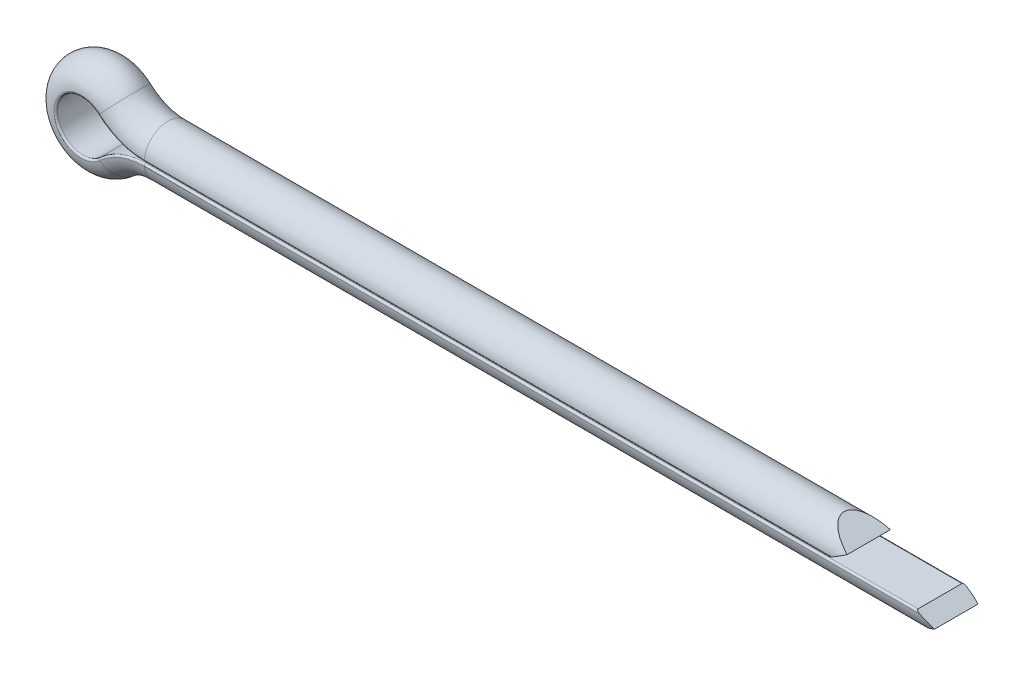
ISO-10303-21;
HEADER;
FILE_DESCRIPTION(('STEP AP214'),'2;1');
FILE_NAME('part.step','',(''),(''),'','','');
FILE_SCHEMA(('AUTOMOTIVE_DESIGN { 1 0 10303 214 1 1 1 1 }'));
ENDSEC;
DATA;
#1=APPLICATION_CONTEXT('core data for automotive mechanical design processes');
#2=APPLICATION_PROTOCOL_DEFINITION('international standard','automotive_design',2000,#1);
#3=PRODUCT_CONTEXT('',#1,'mechanical');
#4=PRODUCT('Part','Part','',(#3));
#5=PRODUCT_RELATED_PRODUCT_CATEGORY('part','',(#4));
#6=PRODUCT_DEFINITION_FORMATION('','',#4);
#7=PRODUCT_DEFINITION_CONTEXT('part definition',#1,'design');
#8=PRODUCT_DEFINITION('design','',#6,#7);
#9=PRODUCT_DEFINITION_SHAPE('','',#8);
#10=(LENGTH_UNIT() NAMED_UNIT(*) SI_UNIT(.MILLI.,.METRE.));
#11=(NAMED_UNIT(*) PLANE_ANGLE_UNIT() SI_UNIT($,.RADIAN.));
#12=(NAMED_UNIT(*) SI_UNIT($,.STERADIAN.) SOLID_ANGLE_UNIT());
#13=UNCERTAINTY_MEASURE_WITH_UNIT(LENGTH_MEASURE(1.E-05),#10,'distance_accuracy_value','');
#14=(GEOMETRIC_REPRESENTATION_CONTEXT(3) GLOBAL_UNCERTAINTY_ASSIGNED_CONTEXT((#13)) GLOBAL_UNIT_ASSIGNED_CONTEXT((#10,
#11,#12)) REPRESENTATION_CONTEXT('',''));
#15=CARTESIAN_POINT('',(0.,0.,0.));
#16=DIRECTION('',(0.,0.,1.));
#17=DIRECTION('',(1.,0.,0.));
#18=AXIS2_PLACEMENT_3D('',#15,#16,#17);
#19=CARTESIAN_POINT('',(21.8,0.0249999999999998,0.));
#20=DIRECTION('',(-1.,0.,0.));
#21=DIRECTION('',(0.,0.,1.));
#22=AXIS2_PLACEMENT_3D('',#19,#20,#21);
#23=CYLINDRICAL_SURFACE('',#22,0.675);
#24=CARTESIAN_POINT('',(1.8,0.0249999999999998,0.));
#25=DIRECTION('',(1.,0.,0.));
#26=DIRECTION('',(0.,0.,1.));
#27=AXIS2_PLACEMENT_3D('',#24,#25,#26);
#28=CIRCLE('',#27,0.675);
#29=CARTESIAN_POINT('',(1.8,0.0789999999999996,-0.672836532896364));
#30=VERTEX_POINT('',#29);
#31=CARTESIAN_POINT('',(1.8,0.0789999999999996,0.672836532896364));
#32=VERTEX_POINT('',#31);
#33=EDGE_CURVE('E171',#30,#32,#28,.T.);
#34=ORIENTED_EDGE('',*,*,#33,.T.);
#35=DIRECTION('',(-1.,0.,0.));
#36=VECTOR('',#35,1.);
#37=CARTESIAN_POINT('',(21.8,0.0789999999999996,0.672836532896364));
#38=LINE('',#37,#36);
#39=CARTESIAN_POINT('',(21.4258770255651,0.0789999999999993,0.672836532896364));
#40=VERTEX_POINT('',#39);
#41=EDGE_CURVE('E49',#32,#40,#38,.F.);
#42=ORIENTED_EDGE('',*,*,#41,.T.);
#43=CARTESIAN_POINT('',(21.3323462819564,0.0249999999999998,0.));
#44=DIRECTION('',(-0.500000000000001,0.866025403784438,0.));
#45=DIRECTION('',(-0.866025403784438,-0.500000000000002,0.));
#46=AXIS2_PLACEMENT_3D('',#43,#44,#45);
#47=ELLIPSE('',#46,1.35,0.675);
#48=CARTESIAN_POINT('',(21.8,0.295,0.618647718819038));
#49=VERTEX_POINT('',#48);
#50=EDGE_CURVE('E170',#40,#49,#47,.T.);
#51=ORIENTED_EDGE('',*,*,#50,.T.);
#52=CARTESIAN_POINT('',(22.2676537180436,0.0249999999999998,0.));
#53=DIRECTION('',(-0.499999999999994,-0.866025403784442,0.));
#54=DIRECTION('',(-0.866025403784442,0.499999999999994,0.));
#55=AXIS2_PLACEMENT_3D('',#52,#53,#54);
#56=ELLIPSE('',#55,1.35000000000002,0.675);
#57=CARTESIAN_POINT('',(21.8,0.295,-0.618647718819039));
#58=VERTEX_POINT('',#57);
#59=EDGE_CURVE('E154',#49,#58,#56,.T.);
#60=ORIENTED_EDGE('',*,*,#59,.T.);
#61=CARTESIAN_POINT('',(21.4258770255651,0.0789999999999993,-0.672836532896364));
#62=VERTEX_POINT('',#61);
#63=EDGE_CURVE('E168',#58,#62,#47,.T.);
#64=ORIENTED_EDGE('',*,*,#63,.T.);
#65=DIRECTION('',(-1.,0.,0.));
#66=VECTOR('',#65,1.);
#67=CARTESIAN_POINT('',(21.8,0.0789999999999996,-0.672836532896364));
#68=LINE('',#67,#66);
#69=EDGE_CURVE('E234',#62,#30,#68,.T.);
#70=ORIENTED_EDGE('',*,*,#69,.T.);
#71=EDGE_LOOP('',(#34,#42,#51,#60,#64,#70));
#72=FACE_BOUND('',#71,.T.);
#73=ADVANCED_FACE('F32',(#72),#23,.T.);
#74=CARTESIAN_POINT('',(21.8,0.0249999999999996,-0.675));
#75=DIRECTION('',(0.,1.,0.));
#76=DIRECTION('',(0.,0.,1.));
#77=AXIS2_PLACEMENT_3D('',#74,#75,#76);
#78=PLANE('',#77);
#79=DIRECTION('',(0.,0.,1.));
#80=VECTOR('',#79,1.);
#81=CARTESIAN_POINT('',(21.3323462819564,0.0249999999999996,-0.675));
#82=LINE('',#81,#80);
#83=CARTESIAN_POINT('',(21.3323462819564,0.0249999999999996,-0.622996789718856));
#84=VERTEX_POINT('',#83);
#85=CARTESIAN_POINT('',(21.3323462819564,0.0249999999999996,0.622996789718855));
#86=VERTEX_POINT('',#85);
#87=EDGE_CURVE('E148',#84,#86,#82,.T.);
#88=ORIENTED_EDGE('',*,*,#87,.T.);
#89=DIRECTION('',(-1.,0.,0.));
#90=VECTOR('',#89,1.);
#91=CARTESIAN_POINT('',(21.8,0.0249999999999996,0.622996789718856));
#92=LINE('',#91,#90);
#93=CARTESIAN_POINT('',(1.8,0.0249999999999996,0.622996789718855));
#94=VERTEX_POINT('',#93);
#95=EDGE_CURVE('E232',#86,#94,#92,.T.);
#96=ORIENTED_EDGE('',*,*,#95,.T.);
#97=DIRECTION('',(0.,0.,-1.));
#98=VECTOR('',#97,1.);
#99=CARTESIAN_POINT('',(1.8,0.0249999999999996,-0.675));
#100=LINE('',#99,#98);
#101=CARTESIAN_POINT('',(1.8,0.0249999999999996,-0.622996789718856));
#102=VERTEX_POINT('',#101);
#103=EDGE_CURVE('E173',#94,#102,#100,.T.);
#104=ORIENTED_EDGE('',*,*,#103,.T.);
#105=DIRECTION('',(-1.,0.,0.));
#106=VECTOR('',#105,1.);
#107=CARTESIAN_POINT('',(21.8,0.0249999999999996,-0.622996789718856));
#108=LINE('',#107,#106);
#109=EDGE_CURVE('E230',#102,#84,#108,.F.);
#110=ORIENTED_EDGE('',*,*,#109,.T.);
#111=EDGE_LOOP('',(#88,#96,#104,#110));
#112=FACE_BOUND('',#111,.T.);
#113=ADVANCED_FACE('F271',(#112),#78,.F.);
#114=CARTESIAN_POINT('',(1.8,1.96428571428572,0.));
#115=DIRECTION('',(0.,0.,-1.));
#116=DIRECTION('',(-1.,0.,0.));
#117=AXIS2_PLACEMENT_3D('',#114,#115,#116);
#118=TOROIDAL_SURFACE('',#117,1.93928571428572,0.675);
#119=CARTESIAN_POINT('',(0.489812332439676,0.534517426273459,0.));
#120=DIRECTION('',(0.737265415549598,-0.675603217158177,0.));
#121=DIRECTION('',(0.,0.,1.));
#122=AXIS2_PLACEMENT_3D('',#119,#120,#121);
#123=CIRCLE('',#122,0.675);
#124=CARTESIAN_POINT('',(0.526294906166815,0.57432975871379,-0.672836532896221));
#125=VERTEX_POINT('',#124);
#126=CARTESIAN_POINT('',(0.526294906166792,0.574329758713765,0.672836532896226));
#127=VERTEX_POINT('',#126);
#128=EDGE_CURVE('E174',#125,#127,#123,.T.);
#129=ORIENTED_EDGE('',*,*,#128,.T.);
#130=CARTESIAN_POINT('',(1.8,1.96428571428572,0.672836532896226));
#131=DIRECTION('',(0.,0.,-1.));
#132=DIRECTION('',(-1.,0.,0.));
#133=AXIS2_PLACEMENT_3D('',#130,#131,#132);
#134=CIRCLE('',#133,1.88528571428573);
#135=EDGE_CURVE('E228',#127,#32,#134,.F.);
#136=ORIENTED_EDGE('',*,*,#135,.T.);
#137=ORIENTED_EDGE('',*,*,#33,.F.);
#138=CARTESIAN_POINT('',(1.8,1.96428571428572,-0.672836532896221));
#139=DIRECTION('',(0.,0.,1.));
#140=DIRECTION('',(1.,0.,0.));
#141=AXIS2_PLACEMENT_3D('',#138,#139,#140);
#142=CIRCLE('',#141,1.88528571428573);
#143=EDGE_CURVE('E226',#30,#125,#142,.F.);
#144=ORIENTED_EDGE('',*,*,#143,.T.);
#145=EDGE_LOOP('',(#129,#136,#137,#144));
#146=FACE_BOUND('',#145,.T.);
#147=ADVANCED_FACE('F348',(#146),#118,.T.);
#148=CARTESIAN_POINT('',(1.8,1.96428571428572,0.));
#149=DIRECTION('',(0.,0.,-1.));
#150=DIRECTION('',(-1.,0.,0.));
#151=AXIS2_PLACEMENT_3D('',#148,#149,#150);
#152=CYLINDRICAL_SURFACE('',#151,1.93928571428572);
#153=ORIENTED_EDGE('',*,*,#103,.F.);
#154=CARTESIAN_POINT('',(1.8,1.96428571428572,0.622996789718856));
#155=DIRECTION('',(0.,0.,1.));
#156=DIRECTION('',(1.,0.,0.));
#157=AXIS2_PLACEMENT_3D('',#154,#155,#156);
#158=CIRCLE('',#157,1.93928571428572);
#159=CARTESIAN_POINT('',(0.489812332439676,0.534517426273459,0.622996789718855));
#160=VERTEX_POINT('',#159);
#161=EDGE_CURVE('E224',#94,#160,#158,.F.);
#162=ORIENTED_EDGE('',*,*,#161,.T.);
#163=DIRECTION('',(0.,0.,-1.));
#164=VECTOR('',#163,1.);
#165=CARTESIAN_POINT('',(0.489812332439676,0.534517426273459,-0.675));
#166=LINE('',#165,#164);
#167=CARTESIAN_POINT('',(0.489812332439676,0.534517426273459,-0.622996789718856));
#168=VERTEX_POINT('',#167);
#169=EDGE_CURVE('E177',#160,#168,#166,.T.);
#170=ORIENTED_EDGE('',*,*,#169,.T.);
#171=CARTESIAN_POINT('',(1.8,1.96428571428572,-0.622996789718856));
#172=DIRECTION('',(0.,0.,1.));
#173=DIRECTION('',(1.,0.,0.));
#174=AXIS2_PLACEMENT_3D('',#171,#172,#173);
#175=CIRCLE('',#174,1.93928571428572);
#176=EDGE_CURVE('E222',#168,#102,#175,.T.);
#177=ORIENTED_EDGE('',*,*,#176,.T.);
#178=EDGE_LOOP('',(#153,#162,#170,#177));
#179=FACE_BOUND('',#178,.T.);
#180=ADVANCED_FACE('F281',(#179),#152,.T.);
#181=CARTESIAN_POINT('',(0.,0.,0.));
#182=DIRECTION('',(0.,0.,1.));
#183=DIRECTION('',(1.,0.,0.));
#184=AXIS2_PLACEMENT_3D('',#181,#182,#183);
#185=TOROIDAL_SURFACE('',#184,0.725,0.675);
#186=CARTESIAN_POINT('',(0.489812332439676,-0.534517426273459,0.));
#187=DIRECTION('',(-0.737265415549598,-0.675603217158177,0.));
#188=DIRECTION('',(0.,0.,1.));
#189=AXIS2_PLACEMENT_3D('',#186,#187,#188);
#190=CIRCLE('',#189,0.675);
#191=CARTESIAN_POINT('',(0.526294906166266,-0.574329758713191,-0.672836532896352));
#192=VERTEX_POINT('',#191);
#193=CARTESIAN_POINT('',(0.526294906166212,-0.574329758713132,0.672836532896365));
#194=VERTEX_POINT('',#193);
#195=EDGE_CURVE('E178',#192,#194,#190,.T.);
#196=ORIENTED_EDGE('',*,*,#195,.T.);
#197=CARTESIAN_POINT('',(0.,0.,0.672836532896365));
#198=DIRECTION('',(0.,0.,-1.));
#199=DIRECTION('',(-1.,0.,0.));
#200=AXIS2_PLACEMENT_3D('',#197,#198,#199);
#201=CIRCLE('',#200,0.779);
#202=EDGE_CURVE('E220',#194,#127,#201,.T.);
#203=ORIENTED_EDGE('',*,*,#202,.T.);
#204=ORIENTED_EDGE('',*,*,#128,.F.);
#205=CARTESIAN_POINT('',(0.,0.,-0.672836532896352));
#206=DIRECTION('',(0.,0.,1.));
#207=DIRECTION('',(1.,0.,0.));
#208=AXIS2_PLACEMENT_3D('',#205,#206,#207);
#209=CIRCLE('',#208,0.778999999999999);
#210=EDGE_CURVE('E218',#125,#192,#209,.T.);
#211=ORIENTED_EDGE('',*,*,#210,.T.);
#212=EDGE_LOOP('',(#196,#203,#204,#211));
#213=FACE_BOUND('',#212,.T.);
#214=ADVANCED_FACE('F320',(#213),#185,.T.);
#215=CARTESIAN_POINT('',(0.,0.,0.));
#216=DIRECTION('',(0.,0.,1.));
#217=DIRECTION('',(1.,0.,0.));
#218=AXIS2_PLACEMENT_3D('',#215,#216,#217);
#219=CYLINDRICAL_SURFACE('',#218,0.725);
#220=ORIENTED_EDGE('',*,*,#169,.F.);
#221=CARTESIAN_POINT('',(0.,0.,0.622996789718856));
#222=DIRECTION('',(0.,0.,-1.));
#223=DIRECTION('',(-1.,0.,0.));
#224=AXIS2_PLACEMENT_3D('',#221,#222,#223);
#225=CIRCLE('',#224,0.725);
#226=CARTESIAN_POINT('',(0.489812332439676,-0.534517426273459,0.622996789718855));
#227=VERTEX_POINT('',#226);
#228=EDGE_CURVE('E216',#160,#227,#225,.F.);
#229=ORIENTED_EDGE('',*,*,#228,.T.);
#230=DIRECTION('',(0.,0.,-1.));
#231=VECTOR('',#230,1.);
#232=CARTESIAN_POINT('',(0.489812332439676,-0.534517426273459,-0.675));
#233=LINE('',#232,#231);
#234=CARTESIAN_POINT('',(0.489812332439676,-0.534517426273459,-0.622996789718856));
#235=VERTEX_POINT('',#234);
#236=EDGE_CURVE('E181',#227,#235,#233,.T.);
#237=ORIENTED_EDGE('',*,*,#236,.T.);
#238=CARTESIAN_POINT('',(0.,0.,-0.622996789718856));
#239=DIRECTION('',(0.,0.,-1.));
#240=DIRECTION('',(-1.,0.,0.));
#241=AXIS2_PLACEMENT_3D('',#238,#239,#240);
#242=CIRCLE('',#241,0.725);
#243=EDGE_CURVE('E214',#235,#168,#242,.T.);
#244=ORIENTED_EDGE('',*,*,#243,.T.);
#245=EDGE_LOOP('',(#220,#229,#237,#244));
#246=FACE_BOUND('',#245,.T.);
#247=ADVANCED_FACE('F285',(#246),#219,.F.);
#248=CARTESIAN_POINT('',(1.8,-1.96428571428572,0.));
#249=DIRECTION('',(0.,0.,-1.));
#250=DIRECTION('',(-1.,0.,0.));
#251=AXIS2_PLACEMENT_3D('',#248,#249,#250);
#252=TOROIDAL_SURFACE('',#251,1.93928571428572,0.675);
#253=CARTESIAN_POINT('',(1.8,-0.0249999999999998,0.));
#254=DIRECTION('',(-1.,0.,0.));
#255=DIRECTION('',(0.,0.,1.));
#256=AXIS2_PLACEMENT_3D('',#253,#254,#255);
#257=CIRCLE('',#256,0.675);
#258=CARTESIAN_POINT('',(1.8,-0.0790000000008683,-0.672836532896224));
#259=VERTEX_POINT('',#258);
#260=CARTESIAN_POINT('',(1.8,-0.0790000000013898,0.672836532896139));
#261=VERTEX_POINT('',#260);
#262=EDGE_CURVE('E182',#259,#261,#257,.T.);
#263=ORIENTED_EDGE('',*,*,#262,.T.);
#264=CARTESIAN_POINT('',(1.8,-1.96428571428572,0.672836532896139));
#265=DIRECTION('',(0.,0.,-1.));
#266=DIRECTION('',(-1.,0.,0.));
#267=AXIS2_PLACEMENT_3D('',#264,#265,#266);
#268=CIRCLE('',#267,1.88528571428573);
#269=EDGE_CURVE('E212',#261,#194,#268,.F.);
#270=ORIENTED_EDGE('',*,*,#269,.T.);
#271=ORIENTED_EDGE('',*,*,#195,.F.);
#272=CARTESIAN_POINT('',(1.8,-1.96428571428572,-0.672836532896224));
#273=DIRECTION('',(0.,0.,1.));
#274=DIRECTION('',(1.,0.,0.));
#275=AXIS2_PLACEMENT_3D('',#272,#273,#274);
#276=CIRCLE('',#275,1.88528571428573);
#277=EDGE_CURVE('E210',#192,#259,#276,.F.);
#278=ORIENTED_EDGE('',*,*,#277,.T.);
#279=EDGE_LOOP('',(#263,#270,#271,#278));
#280=FACE_BOUND('',#279,.T.);
#281=ADVANCED_FACE('F322',(#280),#252,.T.);
#282=CARTESIAN_POINT('',(1.8,-1.96428571428572,0.));
#283=DIRECTION('',(0.,0.,-1.));
#284=DIRECTION('',(-1.,0.,0.));
#285=AXIS2_PLACEMENT_3D('',#282,#283,#284);
#286=CYLINDRICAL_SURFACE('',#285,1.93928571428572);
#287=ORIENTED_EDGE('',*,*,#236,.F.);
#288=CARTESIAN_POINT('',(1.8,-1.96428571428572,0.622996789718856));
#289=DIRECTION('',(0.,0.,1.));
#290=DIRECTION('',(1.,0.,0.));
#291=AXIS2_PLACEMENT_3D('',#288,#289,#290);
#292=CIRCLE('',#291,1.93928571428572);
#293=CARTESIAN_POINT('',(1.8,-0.0249999999999996,0.622996789718855));
#294=VERTEX_POINT('',#293);
#295=EDGE_CURVE('E208',#227,#294,#292,.F.);
#296=ORIENTED_EDGE('',*,*,#295,.T.);
#297=DIRECTION('',(0.,0.,-1.));
#298=VECTOR('',#297,1.);
#299=CARTESIAN_POINT('',(1.8,-0.0249999999999996,-0.675));
#300=LINE('',#299,#298);
#301=CARTESIAN_POINT('',(1.8,-0.0249999999999996,-0.622996789718856));
#302=VERTEX_POINT('',#301);
#303=EDGE_CURVE('E155',#294,#302,#300,.T.);
#304=ORIENTED_EDGE('',*,*,#303,.T.);
#305=CARTESIAN_POINT('',(1.8,-1.96428571428572,-0.622996789718856));
#306=DIRECTION('',(0.,0.,1.));
#307=DIRECTION('',(1.,0.,0.));
#308=AXIS2_PLACEMENT_3D('',#305,#306,#307);
#309=CIRCLE('',#308,1.93928571428572);
#310=EDGE_CURVE('E206',#302,#235,#309,.T.);
#311=ORIENTED_EDGE('',*,*,#310,.T.);
#312=EDGE_LOOP('',(#287,#296,#304,#311));
#313=FACE_BOUND('',#312,.T.);
#314=ADVANCED_FACE('F303',(#313),#286,.T.);
#315=CARTESIAN_POINT('',(1.8,-0.0249999999999998,0.));
#316=DIRECTION('',(1.,0.,0.));
#317=DIRECTION('',(0.,0.,-1.));
#318=AXIS2_PLACEMENT_3D('',#315,#316,#317);
#319=CYLINDRICAL_SURFACE('',#318,0.675);
#320=CARTESIAN_POINT('',(23.8323462819564,-0.0249999999999998,0.));
#321=DIRECTION('',(-0.500000000000002,-0.866025403784438,0.));
#322=DIRECTION('',(0.866025403784438,-0.500000000000002,0.));
#323=AXIS2_PLACEMENT_3D('',#320,#321,#322);
#324=ELLIPSE('',#323,1.35,0.675);
#325=CARTESIAN_POINT('',(24.3,-0.294999999999999,0.618647718819039));
#326=VERTEX_POINT('',#325);
#327=CARTESIAN_POINT('',(23.9258770255651,-0.0789999999999992,0.672836532896364));
#328=VERTEX_POINT('',#327);
#329=EDGE_CURVE('E147',#326,#328,#324,.T.);
#330=ORIENTED_EDGE('',*,*,#329,.T.);
#331=DIRECTION('',(1.,0.,0.));
#332=VECTOR('',#331,1.);
#333=CARTESIAN_POINT('',(1.8,-0.0789999999999996,0.672836532896364));
#334=LINE('',#333,#332);
#335=EDGE_CURVE('E204',#328,#261,#334,.F.);
#336=ORIENTED_EDGE('',*,*,#335,.T.);
#337=ORIENTED_EDGE('',*,*,#262,.F.);
#338=DIRECTION('',(1.,0.,0.));
#339=VECTOR('',#338,1.);
#340=CARTESIAN_POINT('',(1.8,-0.0789999999999996,-0.672836532896364));
#341=LINE('',#340,#339);
#342=CARTESIAN_POINT('',(23.9258770255651,-0.078999999999999,-0.672836532896364));
#343=VERTEX_POINT('',#342);
#344=EDGE_CURVE('E144',#259,#343,#341,.T.);
#345=ORIENTED_EDGE('',*,*,#344,.T.);
#346=CARTESIAN_POINT('',(24.3,-0.294999999999999,-0.618647718819039));
#347=VERTEX_POINT('',#346);
#348=EDGE_CURVE('E136',#343,#347,#324,.T.);
#349=ORIENTED_EDGE('',*,*,#348,.T.);
#350=CARTESIAN_POINT('',(24.7676537180436,-0.0249999999999998,0.));
#351=DIRECTION('',(-0.499999999999994,0.866025403784442,0.));
#352=DIRECTION('',(0.866025403784442,0.499999999999994,0.));
#353=AXIS2_PLACEMENT_3D('',#350,#351,#352);
#354=ELLIPSE('',#353,1.35000000000002,0.675);
#355=EDGE_CURVE('E140',#347,#326,#354,.T.);
#356=ORIENTED_EDGE('',*,*,#355,.T.);
#357=EDGE_LOOP('',(#330,#336,#337,#345,#349,#356));
#358=FACE_BOUND('',#357,.T.);
#359=ADVANCED_FACE('F139',(#358),#319,.T.);
#360=CARTESIAN_POINT('',(1.8,-0.0249999999999996,-0.675));
#361=DIRECTION('',(0.,-1.,0.));
#362=DIRECTION('',(0.,0.,-1.));
#363=AXIS2_PLACEMENT_3D('',#360,#361,#362);
#364=PLANE('',#363);
#365=ORIENTED_EDGE('',*,*,#303,.F.);
#366=DIRECTION('',(1.,0.,0.));
#367=VECTOR('',#366,1.);
#368=CARTESIAN_POINT('',(1.8,-0.0249999999999996,0.622996789718855));
#369=LINE('',#368,#367);
#370=CARTESIAN_POINT('',(23.8323462819564,-0.0249999999999994,0.622996789718855));
#371=VERTEX_POINT('',#370);
#372=EDGE_CURVE('E196',#294,#371,#369,.T.);
#373=ORIENTED_EDGE('',*,*,#372,.T.);
#374=DIRECTION('',(0.,0.,1.));
#375=VECTOR('',#374,1.);
#376=CARTESIAN_POINT('',(23.8323462819564,-0.0249999999999994,-0.675));
#377=LINE('',#376,#375);
#378=CARTESIAN_POINT('',(23.8323462819564,-0.0249999999999994,-0.622996789718856));
#379=VERTEX_POINT('',#378);
#380=EDGE_CURVE('E160',#379,#371,#377,.T.);
#381=ORIENTED_EDGE('',*,*,#380,.F.);
#382=DIRECTION('',(1.,0.,0.));
#383=VECTOR('',#382,1.);
#384=CARTESIAN_POINT('',(1.8,-0.0249999999999996,-0.622996789718856));
#385=LINE('',#384,#383);
#386=EDGE_CURVE('E194',#379,#302,#385,.F.);
#387=ORIENTED_EDGE('',*,*,#386,.T.);
#388=EDGE_LOOP('',(#365,#373,#381,#387));
#389=FACE_BOUND('',#388,.T.);
#390=ADVANCED_FACE('F306',(#389),#364,.F.);
#391=CARTESIAN_POINT('',(24.3,-0.294999999999999,-0.675));
#392=DIRECTION('',(-0.500000000000002,-0.866025403784438,0.));
#393=DIRECTION('',(0.866025403784438,-0.500000000000002,0.));
#394=AXIS2_PLACEMENT_3D('',#391,#392,#393);
#395=PLANE('',#394);
#396=ORIENTED_EDGE('',*,*,#380,.T.);
#397=CARTESIAN_POINT('',(23.9189488223348,-0.0749999999999996,0.622996789718856));
#398=DIRECTION('',(-0.500000000000002,-0.866025403784438,0.));
#399=DIRECTION('',(0.866025403784438,-0.500000000000002,0.));
#400=AXIS2_PLACEMENT_3D('',#397,#398,#399);
#401=ELLIPSE('',#400,0.0999999999999997,0.05);
#402=EDGE_CURVE('E201',#371,#328,#401,.F.);
#403=ORIENTED_EDGE('',*,*,#402,.T.);
#404=ORIENTED_EDGE('',*,*,#329,.F.);
#405=DIRECTION('',(0.,0.,1.));
#406=VECTOR('',#405,1.);
#407=CARTESIAN_POINT('',(24.3,-0.294999999999999,-0.675));
#408=LINE('',#407,#406);
#409=EDGE_CURVE('E153',#347,#326,#408,.T.);
#410=ORIENTED_EDGE('',*,*,#409,.F.);
#411=ORIENTED_EDGE('',*,*,#348,.F.);
#412=CARTESIAN_POINT('',(23.9189488223348,-0.0749999999999996,-0.622996789718856));
#413=DIRECTION('',(-0.500000000000002,-0.866025403784438,0.));
#414=DIRECTION('',(0.866025403784438,-0.500000000000002,0.));
#415=AXIS2_PLACEMENT_3D('',#412,#413,#414);
#416=ELLIPSE('',#415,0.0999999999999997,0.05);
#417=EDGE_CURVE('E199',#343,#379,#416,.F.);
#418=ORIENTED_EDGE('',*,*,#417,.T.);
#419=EDGE_LOOP('',(#396,#403,#404,#410,#411,#418));
#420=FACE_BOUND('',#419,.T.);
#421=ADVANCED_FACE('F158',(#420),#395,.F.);
#422=CARTESIAN_POINT('',(23.5985194229346,-0.7,-0.675));
#423=DIRECTION('',(-0.499999999999994,0.866025403784442,0.));
#424=DIRECTION('',(-0.866025403784442,-0.499999999999994,0.));
#425=AXIS2_PLACEMENT_3D('',#422,#423,#424);
#426=PLANE('',#425);
#427=ORIENTED_EDGE('',*,*,#409,.T.);
#428=ORIENTED_EDGE('',*,*,#355,.F.);
#429=EDGE_LOOP('',(#427,#428));
#430=FACE_BOUND('',#429,.T.);
#431=ADVANCED_FACE('F152',(#430),#426,.F.);
#432=CARTESIAN_POINT('',(21.8,0.295,-0.675));
#433=DIRECTION('',(-0.499999999999994,-0.866025403784442,0.));
#434=DIRECTION('',(0.866025403784442,-0.499999999999994,0.));
#435=AXIS2_PLACEMENT_3D('',#432,#433,#434);
#436=PLANE('',#435);
#437=ORIENTED_EDGE('',*,*,#59,.F.);
#438=DIRECTION('',(0.,0.,1.));
#439=VECTOR('',#438,1.);
#440=CARTESIAN_POINT('',(21.8,0.295,-0.675));
#441=LINE('',#440,#439);
#442=EDGE_CURVE('E159',#58,#49,#441,.T.);
#443=ORIENTED_EDGE('',*,*,#442,.F.);
#444=EDGE_LOOP('',(#437,#443));
#445=FACE_BOUND('',#444,.T.);
#446=ADVANCED_FACE('F362',(#445),#436,.F.);
#447=CARTESIAN_POINT('',(21.3323462819564,0.0249999999999996,-0.675));
#448=DIRECTION('',(-0.500000000000001,0.866025403784438,0.));
#449=DIRECTION('',(-0.866025403784438,-0.500000000000002,0.));
#450=AXIS2_PLACEMENT_3D('',#447,#448,#449);
#451=PLANE('',#450);
#452=ORIENTED_EDGE('',*,*,#50,.F.);
#453=CARTESIAN_POINT('',(21.4189488223349,0.0749999999999996,0.622996789718856));
#454=DIRECTION('',(-0.500000000000001,0.866025403784438,0.));
#455=DIRECTION('',(-0.866025403784438,-0.500000000000002,0.));
#456=AXIS2_PLACEMENT_3D('',#453,#454,#455);
#457=ELLIPSE('',#456,0.0999999999999997,0.05);
#458=EDGE_CURVE('E11',#40,#86,#457,.F.);
#459=ORIENTED_EDGE('',*,*,#458,.T.);
#460=ORIENTED_EDGE('',*,*,#87,.F.);
#461=CARTESIAN_POINT('',(21.4189488223349,0.0749999999999996,-0.622996789718856));
#462=DIRECTION('',(-0.500000000000001,0.866025403784438,0.));
#463=DIRECTION('',(-0.866025403784438,-0.500000000000002,0.));
#464=AXIS2_PLACEMENT_3D('',#461,#462,#463);
#465=ELLIPSE('',#464,0.0999999999999997,0.05);
#466=EDGE_CURVE('E41',#84,#62,#465,.F.);
#467=ORIENTED_EDGE('',*,*,#466,.T.);
#468=ORIENTED_EDGE('',*,*,#63,.F.);
#469=ORIENTED_EDGE('',*,*,#442,.T.);
#470=EDGE_LOOP('',(#452,#459,#460,#467,#468,#469));
#471=FACE_BOUND('',#470,.T.);
#472=ADVANCED_FACE('F274',(#471),#451,.F.);
#473=CARTESIAN_POINT('',(21.8,0.0749999999999996,0.622996789718856));
#474=DIRECTION('',(-1.,0.,0.));
#475=DIRECTION('',(0.,0.,1.));
#476=AXIS2_PLACEMENT_3D('',#473,#474,#475);
#477=CYLINDRICAL_SURFACE('',#476,0.05);
#478=ORIENTED_EDGE('',*,*,#458,.F.);
#479=ORIENTED_EDGE('',*,*,#41,.F.);
#480=CARTESIAN_POINT('',(1.8,0.0749999999999996,0.622996789718856));
#481=DIRECTION('',(-1.,0.,0.));
#482=DIRECTION('',(0.,0.,1.));
#483=AXIS2_PLACEMENT_3D('',#480,#481,#482);
#484=CIRCLE('',#483,0.05);
#485=EDGE_CURVE('E164',#94,#32,#484,.T.);
#486=ORIENTED_EDGE('',*,*,#485,.F.);
#487=ORIENTED_EDGE('',*,*,#95,.F.);
#488=EDGE_LOOP('',(#478,#479,#486,#487));
#489=FACE_BOUND('',#488,.T.);
#490=ADVANCED_FACE('F277',(#489),#477,.T.);
#491=CARTESIAN_POINT('',(1.8,1.96428571428572,0.622996789718856));
#492=DIRECTION('',(0.,0.,1.));
#493=DIRECTION('',(1.,0.,0.));
#494=AXIS2_PLACEMENT_3D('',#491,#492,#493);
#495=TOROIDAL_SURFACE('',#494,1.88928571428572,0.05);
#496=ORIENTED_EDGE('',*,*,#485,.T.);
#497=ORIENTED_EDGE('',*,*,#135,.F.);
#498=CARTESIAN_POINT('',(0.523592493297583,0.571380697050937,0.622996789718856));
#499=DIRECTION('',(-0.737265415549598,0.675603217158177,0.));
#500=DIRECTION('',(-0.675603217158177,-0.737265415549598,0.));
#501=AXIS2_PLACEMENT_3D('',#498,#499,#500);
#502=CIRCLE('',#501,0.05);
#503=EDGE_CURVE('E244',#160,#127,#502,.T.);
#504=ORIENTED_EDGE('',*,*,#503,.F.);
#505=ORIENTED_EDGE('',*,*,#161,.F.);
#506=EDGE_LOOP('',(#496,#497,#504,#505));
#507=FACE_BOUND('',#506,.T.);
#508=ADVANCED_FACE('F290',(#507),#495,.T.);
#509=CARTESIAN_POINT('',(0.,0.,0.622996789718856));
#510=DIRECTION('',(0.,0.,-1.));
#511=DIRECTION('',(-1.,0.,0.));
#512=AXIS2_PLACEMENT_3D('',#509,#510,#511);
#513=TOROIDAL_SURFACE('',#512,0.775,0.05);
#514=ORIENTED_EDGE('',*,*,#503,.T.);
#515=ORIENTED_EDGE('',*,*,#202,.F.);
#516=CARTESIAN_POINT('',(0.523592493297585,-0.57138069705094,0.622996789718856));
#517=DIRECTION('',(0.7372654155496,0.675603217158175,0.));
#518=DIRECTION('',(-0.675603217158175,0.7372654155496,0.));
#519=AXIS2_PLACEMENT_3D('',#516,#517,#518);
#520=CIRCLE('',#519,0.05);
#521=EDGE_CURVE('E241',#227,#194,#520,.T.);
#522=ORIENTED_EDGE('',*,*,#521,.F.);
#523=ORIENTED_EDGE('',*,*,#228,.F.);
#524=EDGE_LOOP('',(#514,#515,#522,#523));
#525=FACE_BOUND('',#524,.T.);
#526=ADVANCED_FACE('F294',(#525),#513,.T.);
#527=CARTESIAN_POINT('',(1.8,-1.96428571428572,0.622996789718856));
#528=DIRECTION('',(0.,0.,1.));
#529=DIRECTION('',(1.,0.,0.));
#530=AXIS2_PLACEMENT_3D('',#527,#528,#529);
#531=TOROIDAL_SURFACE('',#530,1.88928571428572,0.05);
#532=ORIENTED_EDGE('',*,*,#521,.T.);
#533=ORIENTED_EDGE('',*,*,#269,.F.);
#534=CARTESIAN_POINT('',(1.8,-0.0749999999999988,0.622996789718856));
#535=DIRECTION('',(1.,0.,0.));
#536=DIRECTION('',(0.,0.,-1.));
#537=AXIS2_PLACEMENT_3D('',#534,#535,#536);
#538=CIRCLE('',#537,0.05);
#539=EDGE_CURVE('E238',#294,#261,#538,.T.);
#540=ORIENTED_EDGE('',*,*,#539,.F.);
#541=ORIENTED_EDGE('',*,*,#295,.F.);
#542=EDGE_LOOP('',(#532,#533,#540,#541));
#543=FACE_BOUND('',#542,.T.);
#544=ADVANCED_FACE('F299',(#543),#531,.T.);
#545=CARTESIAN_POINT('',(1.8,-0.0749999999999996,0.622996789718856));
#546=DIRECTION('',(1.,0.,0.));
#547=DIRECTION('',(0.,0.,-1.));
#548=AXIS2_PLACEMENT_3D('',#545,#546,#547);
#549=CYLINDRICAL_SURFACE('',#548,0.05);
#550=ORIENTED_EDGE('',*,*,#539,.T.);
#551=ORIENTED_EDGE('',*,*,#335,.F.);
#552=ORIENTED_EDGE('',*,*,#402,.F.);
#553=ORIENTED_EDGE('',*,*,#372,.F.);
#554=EDGE_LOOP('',(#550,#551,#552,#553));
#555=FACE_BOUND('',#554,.T.);
#556=ADVANCED_FACE('F325',(#555),#549,.T.);
#557=CARTESIAN_POINT('',(21.8,0.0749999999999996,-0.622996789718856));
#558=DIRECTION('',(-1.,0.,0.));
#559=DIRECTION('',(0.,0.,1.));
#560=AXIS2_PLACEMENT_3D('',#557,#558,#559);
#561=CYLINDRICAL_SURFACE('',#560,0.05);
#562=ORIENTED_EDGE('',*,*,#466,.F.);
#563=ORIENTED_EDGE('',*,*,#109,.F.);
#564=CARTESIAN_POINT('',(1.8,0.0749999999999996,-0.622996789718856));
#565=DIRECTION('',(-1.,0.,0.));
#566=DIRECTION('',(0.,0.,1.));
#567=AXIS2_PLACEMENT_3D('',#564,#565,#566);
#568=CIRCLE('',#567,0.05);
#569=EDGE_CURVE('E36',#30,#102,#568,.T.);
#570=ORIENTED_EDGE('',*,*,#569,.F.);
#571=ORIENTED_EDGE('',*,*,#69,.F.);
#572=EDGE_LOOP('',(#562,#563,#570,#571));
#573=FACE_BOUND('',#572,.T.);
#574=ADVANCED_FACE('F34',(#573),#561,.T.);
#575=CARTESIAN_POINT('',(1.8,1.96428571428572,-0.622996789718856));
#576=DIRECTION('',(0.,0.,1.));
#577=DIRECTION('',(1.,0.,0.));
#578=AXIS2_PLACEMENT_3D('',#575,#576,#577);
#579=TOROIDAL_SURFACE('',#578,1.88928571428572,0.05);
#580=ORIENTED_EDGE('',*,*,#569,.T.);
#581=ORIENTED_EDGE('',*,*,#176,.F.);
#582=CARTESIAN_POINT('',(0.523592493297583,0.571380697050937,-0.622996789718856));
#583=DIRECTION('',(-0.737265415549597,0.675603217158177,0.));
#584=DIRECTION('',(-0.675603217158177,-0.737265415549597,0.));
#585=AXIS2_PLACEMENT_3D('',#582,#583,#584);
#586=CIRCLE('',#585,0.05);
#587=EDGE_CURVE('E254',#125,#168,#586,.T.);
#588=ORIENTED_EDGE('',*,*,#587,.F.);
#589=ORIENTED_EDGE('',*,*,#143,.F.);
#590=EDGE_LOOP('',(#580,#581,#588,#589));
#591=FACE_BOUND('',#590,.T.);
#592=ADVANCED_FACE('F265',(#591),#579,.T.);
#593=CARTESIAN_POINT('',(0.,0.,-0.622996789718856));
#594=DIRECTION('',(0.,0.,-1.));
#595=DIRECTION('',(-1.,0.,0.));
#596=AXIS2_PLACEMENT_3D('',#593,#594,#595);
#597=TOROIDAL_SURFACE('',#596,0.775,0.05);
#598=ORIENTED_EDGE('',*,*,#587,.T.);
#599=ORIENTED_EDGE('',*,*,#243,.F.);
#600=CARTESIAN_POINT('',(0.523592493297585,-0.57138069705094,-0.622996789718856));
#601=DIRECTION('',(0.737265415549599,0.675603217158176,0.));
#602=DIRECTION('',(-0.675603217158176,0.737265415549599,0.));
#603=AXIS2_PLACEMENT_3D('',#600,#601,#602);
#604=CIRCLE('',#603,0.05);
#605=EDGE_CURVE('E252',#192,#235,#604,.T.);
#606=ORIENTED_EDGE('',*,*,#605,.F.);
#607=ORIENTED_EDGE('',*,*,#210,.F.);
#608=EDGE_LOOP('',(#598,#599,#606,#607));
#609=FACE_BOUND('',#608,.T.);
#610=ADVANCED_FACE('F316',(#609),#597,.T.);
#611=CARTESIAN_POINT('',(1.8,-1.96428571428572,-0.622996789718856));
#612=DIRECTION('',(0.,0.,1.));
#613=DIRECTION('',(1.,0.,0.));
#614=AXIS2_PLACEMENT_3D('',#611,#612,#613);
#615=TOROIDAL_SURFACE('',#614,1.88928571428572,0.05);
#616=ORIENTED_EDGE('',*,*,#605,.T.);
#617=ORIENTED_EDGE('',*,*,#310,.F.);
#618=CARTESIAN_POINT('',(1.8,-0.0749999999999987,-0.622996789718856));
#619=DIRECTION('',(1.,0.,0.));
#620=DIRECTION('',(0.,0.,-1.));
#621=AXIS2_PLACEMENT_3D('',#618,#619,#620);
#622=CIRCLE('',#621,0.05);
#623=EDGE_CURVE('E249',#259,#302,#622,.T.);
#624=ORIENTED_EDGE('',*,*,#623,.F.);
#625=ORIENTED_EDGE('',*,*,#277,.F.);
#626=EDGE_LOOP('',(#616,#617,#624,#625));
#627=FACE_BOUND('',#626,.T.);
#628=ADVANCED_FACE('F314',(#627),#615,.T.);
#629=CARTESIAN_POINT('',(1.8,-0.0749999999999996,-0.622996789718856));
#630=DIRECTION('',(1.,0.,0.));
#631=DIRECTION('',(0.,0.,-1.));
#632=AXIS2_PLACEMENT_3D('',#629,#630,#631);
#633=CYLINDRICAL_SURFACE('',#632,0.05);
#634=ORIENTED_EDGE('',*,*,#623,.T.);
#635=ORIENTED_EDGE('',*,*,#386,.F.);
#636=ORIENTED_EDGE('',*,*,#417,.F.);
#637=ORIENTED_EDGE('',*,*,#344,.F.);
#638=EDGE_LOOP('',(#634,#635,#636,#637));
#639=FACE_BOUND('',#638,.T.);
#640=ADVANCED_FACE('F310',(#639),#633,.T.);
#641=CLOSED_SHELL('',(#73,#113,#147,#180,#214,#247,#281,#314,#359,#390,#421,#431,#446,#472,#490,
#508,#526,#544,#556,#574,#592,#610,#628,#640));
#642=MANIFOLD_SOLID_BREP('B2',#641);
#643=ADVANCED_BREP_SHAPE_REPRESENTATION('',(#18,#642),#14);
#644=SHAPE_DEFINITION_REPRESENTATION(#9,#643);
ENDSEC;
END-ISO-10303-21;
